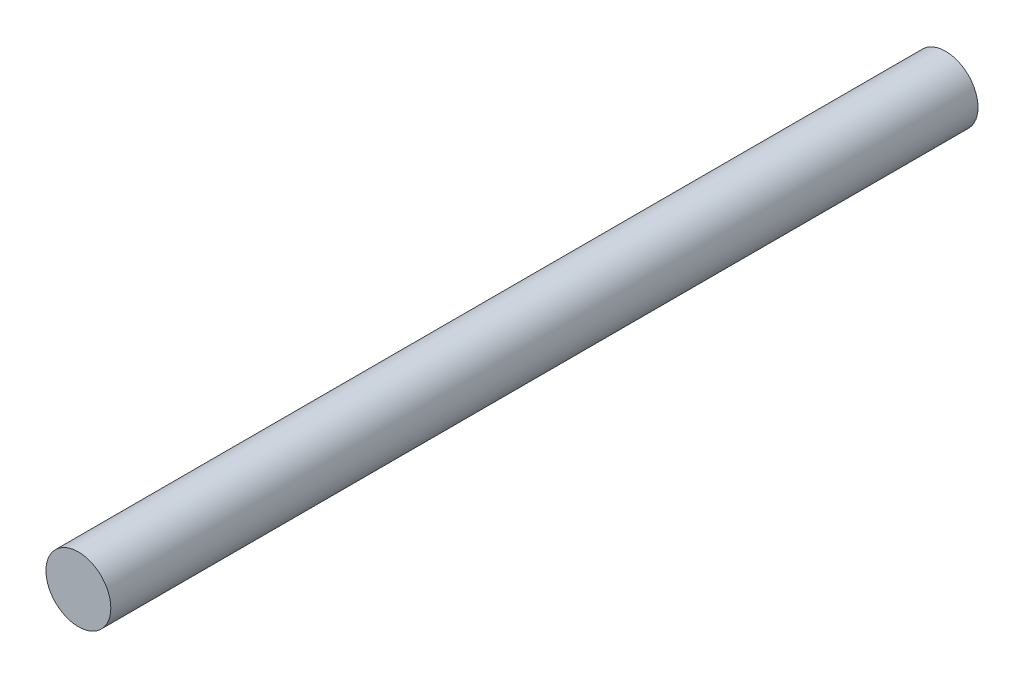
ISO-10303-21;
HEADER;
FILE_DESCRIPTION(('STEP AP214'),'2;1');
FILE_NAME('part.step','',(''),(''),'','','');
FILE_SCHEMA(('AUTOMOTIVE_DESIGN { 1 0 10303 214 1 1 1 1 }'));
ENDSEC;
DATA;
#1=APPLICATION_CONTEXT('core data for automotive mechanical design processes');
#2=APPLICATION_PROTOCOL_DEFINITION('international standard','automotive_design',2000,#1);
#3=PRODUCT_CONTEXT('',#1,'mechanical');
#4=PRODUCT('Part','Part','',(#3));
#5=PRODUCT_RELATED_PRODUCT_CATEGORY('part','',(#4));
#6=PRODUCT_DEFINITION_FORMATION('','',#4);
#7=PRODUCT_DEFINITION_CONTEXT('part definition',#1,'design');
#8=PRODUCT_DEFINITION('design','',#6,#7);
#9=PRODUCT_DEFINITION_SHAPE('','',#8);
#10=(LENGTH_UNIT() NAMED_UNIT(*) SI_UNIT(.MILLI.,.METRE.));
#11=(NAMED_UNIT(*) PLANE_ANGLE_UNIT() SI_UNIT($,.RADIAN.));
#12=(NAMED_UNIT(*) SI_UNIT($,.STERADIAN.) SOLID_ANGLE_UNIT());
#13=UNCERTAINTY_MEASURE_WITH_UNIT(LENGTH_MEASURE(1.E-05),#10,'distance_accuracy_value','');
#14=(GEOMETRIC_REPRESENTATION_CONTEXT(3) GLOBAL_UNCERTAINTY_ASSIGNED_CONTEXT((#13)) GLOBAL_UNIT_ASSIGNED_CONTEXT((#10,
#11,#12)) REPRESENTATION_CONTEXT('',''));
#15=CARTESIAN_POINT('',(0.,0.,0.));
#16=DIRECTION('',(0.,0.,1.));
#17=DIRECTION('',(1.,0.,0.));
#18=AXIS2_PLACEMENT_3D('',#15,#16,#17);
#19=CARTESIAN_POINT('',(-38.1000000000004,0.127000000000085,-63.5000000000001));
#20=DIRECTION('',(0.,0.,-1.));
#21=DIRECTION('',(-0.883269727908218,-0.468865212786088,0.));
#22=AXIS2_PLACEMENT_3D('',#19,#20,#21);
#23=PLANE('',#22);
#24=CARTESIAN_POINT('',(-38.1,0.127,-63.5000000000001));
#25=DIRECTION('',(0.,0.,-1.));
#26=DIRECTION('',(0.,1.,0.));
#27=AXIS2_PLACEMENT_3D('',#24,#25,#26);
#28=CIRCLE('',#27,2.3749);
#29=CARTESIAN_POINT('',(-38.1,2.5019,-63.5000000000001));
#30=VERTEX_POINT('',#29);
#31=EDGE_CURVE('E10',#30,#30,#28,.F.);
#32=ORIENTED_EDGE('',*,*,#31,.F.);
#33=EDGE_LOOP('',(#32));
#34=FACE_BOUND('',#33,.T.);
#35=ADVANCED_FACE('F31',(#34),#23,.T.);
#36=CARTESIAN_POINT('',(-38.1,0.127,0.));
#37=DIRECTION('',(0.,0.,1.));
#38=DIRECTION('',(1.,0.,0.));
#39=AXIS2_PLACEMENT_3D('',#36,#37,#38);
#40=PLANE('',#39);
#41=CARTESIAN_POINT('',(-38.1,0.127,0.));
#42=DIRECTION('',(0.,0.,1.));
#43=DIRECTION('',(1.,0.,0.));
#44=AXIS2_PLACEMENT_3D('',#41,#42,#43);
#45=CIRCLE('',#44,2.3749);
#46=CARTESIAN_POINT('',(-35.7251,0.127,0.));
#47=VERTEX_POINT('',#46);
#48=EDGE_CURVE('E37',#47,#47,#45,.T.);
#49=ORIENTED_EDGE('',*,*,#48,.T.);
#50=EDGE_LOOP('',(#49));
#51=FACE_BOUND('',#50,.T.);
#52=ADVANCED_FACE('F43',(#51),#40,.T.);
#53=CARTESIAN_POINT('',(-38.1,0.127,-70.2172315785598));
#54=DIRECTION('',(0.,0.,1.));
#55=DIRECTION('',(1.,0.,0.));
#56=AXIS2_PLACEMENT_3D('',#53,#54,#55);
#57=CYLINDRICAL_SURFACE('',#56,2.3749);
#58=ORIENTED_EDGE('',*,*,#48,.F.);
#59=EDGE_LOOP('',(#58));
#60=FACE_BOUND('',#59,.T.);
#61=ORIENTED_EDGE('',*,*,#31,.T.);
#62=EDGE_LOOP('',(#61));
#63=FACE_BOUND('',#62,.T.);
#64=ADVANCED_FACE('F45',(#60,#63),#57,.T.);
#65=CLOSED_SHELL('',(#35,#52,#64));
#66=MANIFOLD_SOLID_BREP('B2',#65);
#67=ADVANCED_BREP_SHAPE_REPRESENTATION('',(#18,#66),#14);
#68=SHAPE_DEFINITION_REPRESENTATION(#9,#67);
ENDSEC;
END-ISO-10303-21;
